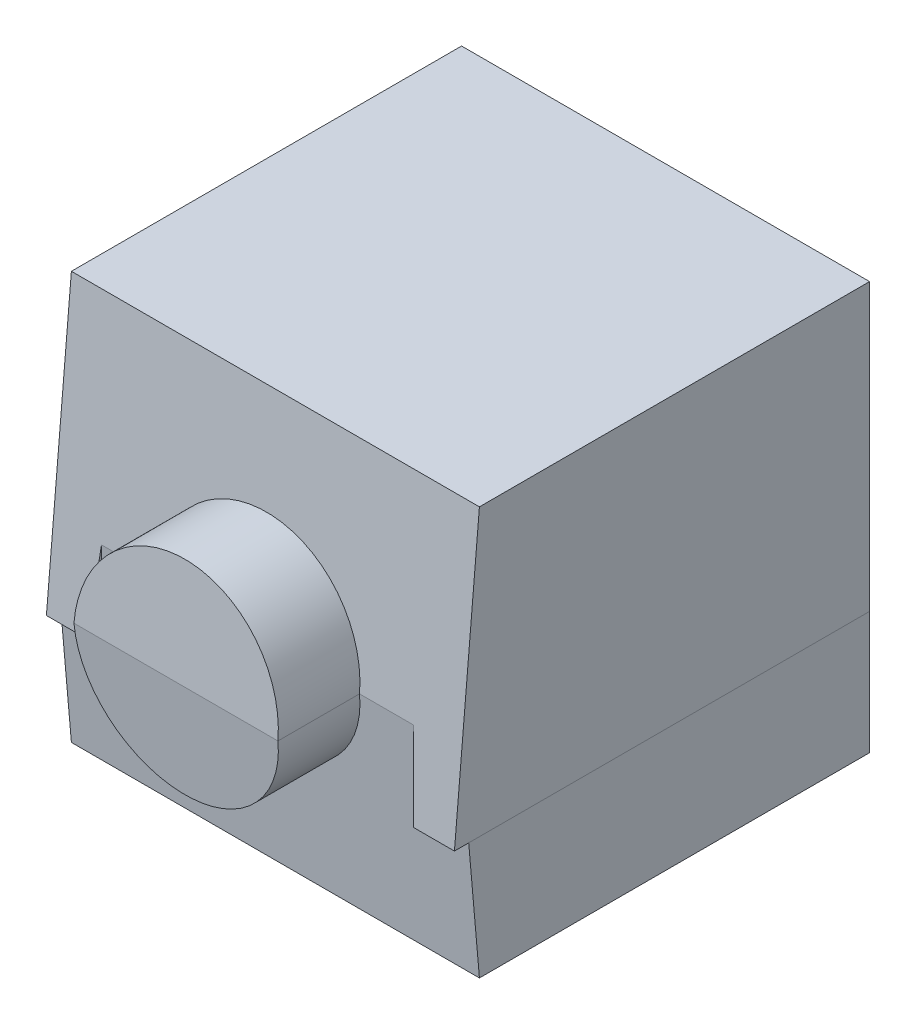
ISO-10303-21;
HEADER;
FILE_DESCRIPTION(('STEP AP214'),'2;1');
FILE_NAME('part.step','',(''),(''),'','','');
FILE_SCHEMA(('AUTOMOTIVE_DESIGN { 1 0 10303 214 1 1 1 1 }'));
ENDSEC;
DATA;
#1=APPLICATION_CONTEXT('core data for automotive mechanical design processes');
#2=APPLICATION_PROTOCOL_DEFINITION('international standard','automotive_design',2000,#1);
#3=PRODUCT_CONTEXT('',#1,'mechanical');
#4=PRODUCT('Part','Part','',(#3));
#5=PRODUCT_RELATED_PRODUCT_CATEGORY('part','',(#4));
#6=PRODUCT_DEFINITION_FORMATION('','',#4);
#7=PRODUCT_DEFINITION_CONTEXT('part definition',#1,'design');
#8=PRODUCT_DEFINITION('design','',#6,#7);
#9=PRODUCT_DEFINITION_SHAPE('','',#8);
#10=(LENGTH_UNIT() NAMED_UNIT(*) SI_UNIT(.MILLI.,.METRE.));
#11=(NAMED_UNIT(*) PLANE_ANGLE_UNIT() SI_UNIT($,.RADIAN.));
#12=(NAMED_UNIT(*) SI_UNIT($,.STERADIAN.) SOLID_ANGLE_UNIT());
#13=UNCERTAINTY_MEASURE_WITH_UNIT(LENGTH_MEASURE(1.E-05),#10,'distance_accuracy_value','');
#14=(GEOMETRIC_REPRESENTATION_CONTEXT(3) GLOBAL_UNCERTAINTY_ASSIGNED_CONTEXT((#13)) GLOBAL_UNIT_ASSIGNED_CONTEXT((#10,
#11,#12)) REPRESENTATION_CONTEXT('',''));
#15=CARTESIAN_POINT('',(0.,0.,0.));
#16=DIRECTION('',(0.,0.,1.));
#17=DIRECTION('',(1.,0.,0.));
#18=AXIS2_PLACEMENT_3D('',#15,#16,#17);
#19=CARTESIAN_POINT('',(5.,-2.,-5.01));
#20=DIRECTION('',(0.,1.,0.));
#21=DIRECTION('',(0.,0.,1.));
#22=AXIS2_PLACEMENT_3D('',#19,#20,#21);
#23=PLANE('',#22);
#24=DIRECTION('',(0.,0.,1.));
#25=VECTOR('',#24,1.);
#26=CARTESIAN_POINT('',(4.,-2.,-5.01));
#27=LINE('',#26,#25);
#28=CARTESIAN_POINT('',(4.,-2.,-5.));
#29=VERTEX_POINT('',#28);
#30=CARTESIAN_POINT('',(4.,-2.,4.82502267294815));
#31=VERTEX_POINT('',#30);
#32=EDGE_CURVE('E12',#29,#31,#27,.T.);
#33=ORIENTED_EDGE('',*,*,#32,.T.);
#34=DIRECTION('',(-1.,0.,0.));
#35=VECTOR('',#34,1.);
#36=CARTESIAN_POINT('',(-5.,-2.,4.82502267294815));
#37=LINE('',#36,#35);
#38=CARTESIAN_POINT('',(5.,-2.,4.82502267294815));
#39=VERTEX_POINT('',#38);
#40=EDGE_CURVE('E172',#31,#39,#37,.F.);
#41=ORIENTED_EDGE('',*,*,#40,.T.);
#42=DIRECTION('',(0.,0.,-1.));
#43=VECTOR('',#42,1.);
#44=CARTESIAN_POINT('',(5.,-2.,-5.));
#45=LINE('',#44,#43);
#46=CARTESIAN_POINT('',(5.,-2.,-5.));
#47=VERTEX_POINT('',#46);
#48=EDGE_CURVE('E175',#39,#47,#45,.T.);
#49=ORIENTED_EDGE('',*,*,#48,.T.);
#50=DIRECTION('',(-1.,0.,0.));
#51=VECTOR('',#50,1.);
#52=CARTESIAN_POINT('',(-5.,-2.,-5.));
#53=LINE('',#52,#51);
#54=EDGE_CURVE('E149',#47,#29,#53,.T.);
#55=ORIENTED_EDGE('',*,*,#54,.T.);
#56=EDGE_LOOP('',(#33,#41,#49,#55));
#57=FACE_BOUND('',#56,.T.);
#58=ADVANCED_FACE('F49',(#57),#23,.T.);
#59=CARTESIAN_POINT('',(-3.82502267294816,0.,-5.01));
#60=DIRECTION('',(0.,1.,0.));
#61=DIRECTION('',(-1.,0.,0.));
#62=AXIS2_PLACEMENT_3D('',#59,#60,#61);
#63=PLANE('',#62);
#64=DIRECTION('',(0.,0.,1.));
#65=VECTOR('',#64,1.);
#66=CARTESIAN_POINT('',(3.82502267294816,0.,-5.01));
#67=LINE('',#66,#65);
#68=CARTESIAN_POINT('',(3.82502267294816,0.,-5.));
#69=VERTEX_POINT('',#68);
#70=CARTESIAN_POINT('',(3.82502267294816,0.,5.));
#71=VERTEX_POINT('',#70);
#72=EDGE_CURVE('E60',#69,#71,#67,.T.);
#73=ORIENTED_EDGE('',*,*,#72,.F.);
#74=DIRECTION('',(-1.,0.,0.));
#75=VECTOR('',#74,1.);
#76=CARTESIAN_POINT('',(-5.,0.,-5.));
#77=LINE('',#76,#75);
#78=CARTESIAN_POINT('',(-3.82502267294816,0.,-5.));
#79=VERTEX_POINT('',#78);
#80=EDGE_CURVE('E208',#69,#79,#77,.T.);
#81=ORIENTED_EDGE('',*,*,#80,.T.);
#82=DIRECTION('',(0.,0.,1.));
#83=VECTOR('',#82,1.);
#84=CARTESIAN_POINT('',(-3.82502267294816,0.,-5.01));
#85=LINE('',#84,#83);
#86=CARTESIAN_POINT('',(-3.82502267294816,0.,5.));
#87=VERTEX_POINT('',#86);
#88=EDGE_CURVE('E193',#79,#87,#85,.T.);
#89=ORIENTED_EDGE('',*,*,#88,.T.);
#90=DIRECTION('',(-1.,0.,0.));
#91=VECTOR('',#90,1.);
#92=CARTESIAN_POINT('',(-5.,0.,5.));
#93=LINE('',#92,#91);
#94=CARTESIAN_POINT('',(-2.5,0.,5.));
#95=VERTEX_POINT('',#94);
#96=EDGE_CURVE('E146',#87,#95,#93,.F.);
#97=ORIENTED_EDGE('',*,*,#96,.T.);
#98=DIRECTION('',(0.,0.,-1.));
#99=VECTOR('',#98,1.);
#100=CARTESIAN_POINT('',(-2.5,0.,7.));
#101=LINE('',#100,#99);
#102=CARTESIAN_POINT('',(-2.5,0.,7.));
#103=VERTEX_POINT('',#102);
#104=EDGE_CURVE('E133',#95,#103,#101,.F.);
#105=ORIENTED_EDGE('',*,*,#104,.T.);
#106=DIRECTION('',(-1.,0.,0.));
#107=VECTOR('',#106,1.);
#108=CARTESIAN_POINT('',(0.,0.,7.));
#109=LINE('',#108,#107);
#110=CARTESIAN_POINT('',(2.5,0.,7.));
#111=VERTEX_POINT('',#110);
#112=EDGE_CURVE('E136',#111,#103,#109,.T.);
#113=ORIENTED_EDGE('',*,*,#112,.F.);
#114=DIRECTION('',(0.,0.,-1.));
#115=VECTOR('',#114,1.);
#116=CARTESIAN_POINT('',(2.5,0.,7.));
#117=LINE('',#116,#115);
#118=CARTESIAN_POINT('',(2.5,0.,5.));
#119=VERTEX_POINT('',#118);
#120=EDGE_CURVE('E130',#111,#119,#117,.T.);
#121=ORIENTED_EDGE('',*,*,#120,.T.);
#122=DIRECTION('',(1.,0.,0.));
#123=VECTOR('',#122,1.);
#124=CARTESIAN_POINT('',(-5.,0.,5.));
#125=LINE('',#124,#123);
#126=EDGE_CURVE('E140',#119,#71,#125,.T.);
#127=ORIENTED_EDGE('',*,*,#126,.T.);
#128=EDGE_LOOP('',(#73,#81,#89,#97,#105,#113,#121,#127));
#129=FACE_BOUND('',#128,.T.);
#130=ADVANCED_FACE('F148',(#129),#63,.T.);
#131=CARTESIAN_POINT('',(4.,-2.,-5.01));
#132=DIRECTION('',(0.996194698091746,0.0871557427476518,0.));
#133=DIRECTION('',(-0.0871557427476518,0.996194698091746,0.));
#134=AXIS2_PLACEMENT_3D('',#131,#132,#133);
#135=PLANE('',#134);
#136=ORIENTED_EDGE('',*,*,#72,.T.);
#137=DIRECTION('',(-0.0868265938642412,0.992432509138968,0.0868265938642477));
#138=VECTOR('',#137,1.);
#139=CARTESIAN_POINT('',(3.75849208544681,0.760448094873979,5.06653058750136));
#140=LINE('',#139,#138);
#141=EDGE_CURVE('E144',#71,#31,#140,.F.);
#142=ORIENTED_EDGE('',*,*,#141,.T.);
#143=ORIENTED_EDGE('',*,*,#32,.F.);
#144=DIRECTION('',(-0.0871557427476518,0.996194698091746,0.));
#145=VECTOR('',#144,1.);
#146=CARTESIAN_POINT('',(3.32386626672073,5.72824393504387,-5.));
#147=LINE('',#146,#145);
#148=EDGE_CURVE('E152',#29,#69,#147,.T.);
#149=ORIENTED_EDGE('',*,*,#148,.T.);
#150=EDGE_LOOP('',(#136,#142,#143,#149));
#151=FACE_BOUND('',#150,.T.);
#152=ADVANCED_FACE('F214',(#151),#135,.T.);
#153=CARTESIAN_POINT('',(-4.,-2.,-5.01));
#154=DIRECTION('',(-0.996194698091746,0.0871557427476518,0.));
#155=DIRECTION('',(-0.0871557427476518,-0.996194698091746,0.));
#156=AXIS2_PLACEMENT_3D('',#153,#154,#155);
#157=PLANE('',#156);
#158=DIRECTION('',(0.,0.,1.));
#159=VECTOR('',#158,1.);
#160=CARTESIAN_POINT('',(-4.,-2.,-5.01));
#161=LINE('',#160,#159);
#162=CARTESIAN_POINT('',(-4.,-2.,-5.));
#163=VERTEX_POINT('',#162);
#164=CARTESIAN_POINT('',(-4.,-2.,4.82502267294815));
#165=VERTEX_POINT('',#164);
#166=EDGE_CURVE('E195',#163,#165,#161,.T.);
#167=ORIENTED_EDGE('',*,*,#166,.T.);
#168=DIRECTION('',(-0.0868265938642412,-0.992432509138968,-0.0868265938642477));
#169=VECTOR('',#168,1.);
#170=CARTESIAN_POINT('',(-3.83388065946747,-0.101247249212811,4.9911420134807));
#171=LINE('',#170,#169);
#172=EDGE_CURVE('E167',#165,#87,#171,.F.);
#173=ORIENTED_EDGE('',*,*,#172,.T.);
#174=ORIENTED_EDGE('',*,*,#88,.F.);
#175=DIRECTION('',(-0.0871557427476518,-0.996194698091746,0.));
#176=VECTOR('',#175,1.);
#177=CARTESIAN_POINT('',(-3.39982750165968,4.86000304670928,-5.));
#178=LINE('',#177,#176);
#179=EDGE_CURVE('E205',#79,#163,#178,.T.);
#180=ORIENTED_EDGE('',*,*,#179,.T.);
#181=EDGE_LOOP('',(#167,#173,#174,#180));
#182=FACE_BOUND('',#181,.T.);
#183=ADVANCED_FACE('F222',(#182),#157,.T.);
#184=CARTESIAN_POINT('',(-5.,-2.,-5.01));
#185=DIRECTION('',(0.,1.,0.));
#186=DIRECTION('',(0.,0.,1.));
#187=AXIS2_PLACEMENT_3D('',#184,#185,#186);
#188=PLANE('',#187);
#189=DIRECTION('',(0.,0.,1.));
#190=VECTOR('',#189,1.);
#191=CARTESIAN_POINT('',(-5.,-2.,-5.));
#192=LINE('',#191,#190);
#193=CARTESIAN_POINT('',(-5.,-2.,-5.));
#194=VERTEX_POINT('',#193);
#195=CARTESIAN_POINT('',(-5.,-2.,4.82502267294815));
#196=VERTEX_POINT('',#195);
#197=EDGE_CURVE('E166',#194,#196,#192,.T.);
#198=ORIENTED_EDGE('',*,*,#197,.T.);
#199=DIRECTION('',(-1.,0.,0.));
#200=VECTOR('',#199,1.);
#201=CARTESIAN_POINT('',(-5.,-2.,4.82502267294815));
#202=LINE('',#201,#200);
#203=EDGE_CURVE('E163',#196,#165,#202,.F.);
#204=ORIENTED_EDGE('',*,*,#203,.T.);
#205=ORIENTED_EDGE('',*,*,#166,.F.);
#206=DIRECTION('',(-1.,0.,0.));
#207=VECTOR('',#206,1.);
#208=CARTESIAN_POINT('',(-5.,-2.,-5.));
#209=LINE('',#208,#207);
#210=EDGE_CURVE('E202',#163,#194,#209,.T.);
#211=ORIENTED_EDGE('',*,*,#210,.T.);
#212=EDGE_LOOP('',(#198,#204,#205,#211));
#213=FACE_BOUND('',#212,.T.);
#214=ADVANCED_FACE('F224',(#213),#188,.T.);
#215=CARTESIAN_POINT('',(-5.,0.,5.));
#216=DIRECTION('',(0.,-0.0871557427476582,0.996194698091746));
#217=DIRECTION('',(0.,-0.996194698091746,-0.0871557427476582));
#218=AXIS2_PLACEMENT_3D('',#215,#216,#217);
#219=PLANE('',#218);
#220=ORIENTED_EDGE('',*,*,#203,.F.);
#221=DIRECTION('',(0.,0.996194698091746,0.0871557427476582));
#222=VECTOR('',#221,1.);
#223=CARTESIAN_POINT('',(-5.,0.,5.));
#224=LINE('',#223,#222);
#225=CARTESIAN_POINT('',(-5.,-5.,4.56255668237038));
#226=VERTEX_POINT('',#225);
#227=EDGE_CURVE('E68',#196,#226,#224,.F.);
#228=ORIENTED_EDGE('',*,*,#227,.T.);
#229=DIRECTION('',(-1.,0.,0.));
#230=VECTOR('',#229,1.);
#231=CARTESIAN_POINT('',(-5.,-5.,4.56255668237038));
#232=LINE('',#231,#230);
#233=CARTESIAN_POINT('',(5.,-5.,4.56255668237038));
#234=VERTEX_POINT('',#233);
#235=EDGE_CURVE('E177',#226,#234,#232,.F.);
#236=ORIENTED_EDGE('',*,*,#235,.T.);
#237=DIRECTION('',(0.,0.996194698091746,0.0871557427476582));
#238=VECTOR('',#237,1.);
#239=CARTESIAN_POINT('',(5.,4.09377849419587,5.35815920922837));
#240=LINE('',#239,#238);
#241=EDGE_CURVE('E160',#39,#234,#240,.F.);
#242=ORIENTED_EDGE('',*,*,#241,.F.);
#243=ORIENTED_EDGE('',*,*,#40,.F.);
#244=ORIENTED_EDGE('',*,*,#141,.F.);
#245=ORIENTED_EDGE('',*,*,#126,.F.);
#246=CARTESIAN_POINT('',(0.,0.,5.));
#247=DIRECTION('',(0.,-0.0871557427476582,0.996194698091746));
#248=DIRECTION('',(0.,-0.996194698091746,-0.0871557427476582));
#249=AXIS2_PLACEMENT_3D('',#246,#247,#248);
#250=ELLIPSE('',#249,2.50954959385837,2.5);
#251=EDGE_CURVE('E125',#95,#119,#250,.T.);
#252=ORIENTED_EDGE('',*,*,#251,.F.);
#253=ORIENTED_EDGE('',*,*,#96,.F.);
#254=ORIENTED_EDGE('',*,*,#172,.F.);
#255=EDGE_LOOP('',(#220,#228,#236,#242,#243,#244,#245,#252,#253,#254));
#256=FACE_BOUND('',#255,.T.);
#257=ADVANCED_FACE('F141',(#256),#219,.T.);
#258=CARTESIAN_POINT('',(0.,0.,7.));
#259=DIRECTION('',(0.,0.,-1.));
#260=DIRECTION('',(-1.,0.,0.));
#261=AXIS2_PLACEMENT_3D('',#258,#259,#260);
#262=CYLINDRICAL_SURFACE('',#261,2.5);
#263=ORIENTED_EDGE('',*,*,#120,.F.);
#264=CARTESIAN_POINT('',(0.,0.,7.));
#265=DIRECTION('',(0.,-0.0871557427476582,0.996194698091746));
#266=DIRECTION('',(0.,-0.996194698091746,-0.0871557427476582));
#267=AXIS2_PLACEMENT_3D('',#264,#265,#266);
#268=ELLIPSE('',#267,2.50954959385837,2.5);
#269=EDGE_CURVE('E53',#103,#111,#268,.T.);
#270=ORIENTED_EDGE('',*,*,#269,.F.);
#271=ORIENTED_EDGE('',*,*,#104,.F.);
#272=ORIENTED_EDGE('',*,*,#251,.T.);
#273=EDGE_LOOP('',(#263,#270,#271,#272));
#274=FACE_BOUND('',#273,.T.);
#275=ADVANCED_FACE('F127',(#274),#262,.T.);
#276=CARTESIAN_POINT('',(0.,0.,7.));
#277=DIRECTION('',(0.,-0.0871557427476582,0.996194698091746));
#278=DIRECTION('',(0.,-0.996194698091746,-0.0871557427476582));
#279=AXIS2_PLACEMENT_3D('',#276,#277,#278);
#280=PLANE('',#279);
#281=ORIENTED_EDGE('',*,*,#269,.T.);
#282=ORIENTED_EDGE('',*,*,#112,.T.);
#283=EDGE_LOOP('',(#281,#282));
#284=FACE_BOUND('',#283,.T.);
#285=ADVANCED_FACE('F51',(#284),#280,.T.);
#286=CARTESIAN_POINT('',(-5.,5.,-5.));
#287=DIRECTION('',(1.,0.,0.));
#288=DIRECTION('',(0.,0.,-1.));
#289=AXIS2_PLACEMENT_3D('',#286,#287,#288);
#290=PLANE('',#289);
#291=ORIENTED_EDGE('',*,*,#197,.F.);
#292=DIRECTION('',(0.,-1.,0.));
#293=VECTOR('',#292,1.);
#294=CARTESIAN_POINT('',(-5.,5.,-5.));
#295=LINE('',#294,#293);
#296=CARTESIAN_POINT('',(-5.,-5.,-5.));
#297=VERTEX_POINT('',#296);
#298=EDGE_CURVE('E159',#194,#297,#295,.T.);
#299=ORIENTED_EDGE('',*,*,#298,.T.);
#300=DIRECTION('',(0.,0.,1.));
#301=VECTOR('',#300,1.);
#302=CARTESIAN_POINT('',(-5.,-5.,-5.));
#303=LINE('',#302,#301);
#304=EDGE_CURVE('E178',#297,#226,#303,.T.);
#305=ORIENTED_EDGE('',*,*,#304,.T.);
#306=ORIENTED_EDGE('',*,*,#227,.F.);
#307=EDGE_LOOP('',(#291,#299,#305,#306));
#308=FACE_BOUND('',#307,.T.);
#309=ADVANCED_FACE('F227',(#308),#290,.F.);
#310=CARTESIAN_POINT('',(0.,-5.,0.));
#311=DIRECTION('',(0.,1.,0.));
#312=DIRECTION('',(0.,0.,1.));
#313=AXIS2_PLACEMENT_3D('',#310,#311,#312);
#314=PLANE('',#313);
#315=ORIENTED_EDGE('',*,*,#304,.F.);
#316=DIRECTION('',(-1.,0.,0.));
#317=VECTOR('',#316,1.);
#318=CARTESIAN_POINT('',(-5.,-5.,-5.));
#319=LINE('',#318,#317);
#320=CARTESIAN_POINT('',(5.,-5.,-5.));
#321=VERTEX_POINT('',#320);
#322=EDGE_CURVE('E162',#321,#297,#319,.T.);
#323=ORIENTED_EDGE('',*,*,#322,.F.);
#324=DIRECTION('',(0.,0.,-1.));
#325=VECTOR('',#324,1.);
#326=CARTESIAN_POINT('',(5.,-5.,-5.));
#327=LINE('',#326,#325);
#328=EDGE_CURVE('E179',#234,#321,#327,.T.);
#329=ORIENTED_EDGE('',*,*,#328,.F.);
#330=ORIENTED_EDGE('',*,*,#235,.F.);
#331=EDGE_LOOP('',(#315,#323,#329,#330));
#332=FACE_BOUND('',#331,.T.);
#333=ADVANCED_FACE('F230',(#332),#314,.F.);
#334=CARTESIAN_POINT('',(5.,5.,-5.));
#335=DIRECTION('',(-1.,0.,0.));
#336=DIRECTION('',(0.,0.,1.));
#337=AXIS2_PLACEMENT_3D('',#334,#335,#336);
#338=PLANE('',#337);
#339=ORIENTED_EDGE('',*,*,#48,.F.);
#340=ORIENTED_EDGE('',*,*,#241,.T.);
#341=ORIENTED_EDGE('',*,*,#328,.T.);
#342=DIRECTION('',(0.,-1.,0.));
#343=VECTOR('',#342,1.);
#344=CARTESIAN_POINT('',(5.,5.,-5.));
#345=LINE('',#344,#343);
#346=EDGE_CURVE('E157',#47,#321,#345,.T.);
#347=ORIENTED_EDGE('',*,*,#346,.F.);
#348=EDGE_LOOP('',(#339,#340,#341,#347));
#349=FACE_BOUND('',#348,.T.);
#350=ADVANCED_FACE('F232',(#349),#338,.F.);
#351=CARTESIAN_POINT('',(-5.,5.,-5.));
#352=DIRECTION('',(0.,0.,1.));
#353=DIRECTION('',(1.,0.,0.));
#354=AXIS2_PLACEMENT_3D('',#351,#352,#353);
#355=PLANE('',#354);
#356=ORIENTED_EDGE('',*,*,#210,.F.);
#357=ORIENTED_EDGE('',*,*,#179,.F.);
#358=ORIENTED_EDGE('',*,*,#80,.F.);
#359=ORIENTED_EDGE('',*,*,#148,.F.);
#360=ORIENTED_EDGE('',*,*,#54,.F.);
#361=ORIENTED_EDGE('',*,*,#346,.T.);
#362=ORIENTED_EDGE('',*,*,#322,.T.);
#363=ORIENTED_EDGE('',*,*,#298,.F.);
#364=EDGE_LOOP('',(#356,#357,#358,#359,#360,#361,#362,#363));
#365=FACE_BOUND('',#364,.T.);
#366=ADVANCED_FACE('F219',(#365),#355,.F.);
#367=CLOSED_SHELL('',(#58,#130,#152,#183,#214,#257,#275,#285,#309,#333,#350,#366));
#368=MANIFOLD_SOLID_BREP('B2',#367);
#369=CARTESIAN_POINT('',(-3.82502267294816,0.,-5.01));
#370=DIRECTION('',(0.,1.,0.));
#371=DIRECTION('',(-1.,0.,0.));
#372=AXIS2_PLACEMENT_3D('',#369,#370,#371);
#373=PLANE('',#372);
#374=DIRECTION('',(0.,0.,1.));
#375=VECTOR('',#374,1.);
#376=CARTESIAN_POINT('',(3.82502267294816,0.,-5.01));
#377=LINE('',#376,#375);
#378=CARTESIAN_POINT('',(3.82502267294816,0.,-5.));
#379=VERTEX_POINT('',#378);
#380=CARTESIAN_POINT('',(3.82502267294816,0.,5.));
#381=VERTEX_POINT('',#380);
#382=EDGE_CURVE('E348',#379,#381,#377,.T.);
#383=ORIENTED_EDGE('',*,*,#382,.T.);
#384=DIRECTION('',(-1.,0.,0.));
#385=VECTOR('',#384,1.);
#386=CARTESIAN_POINT('',(-5.,0.,5.));
#387=LINE('',#386,#385);
#388=CARTESIAN_POINT('',(2.5,0.,5.));
#389=VERTEX_POINT('',#388);
#390=EDGE_CURVE('E441',#389,#381,#387,.F.);
#391=ORIENTED_EDGE('',*,*,#390,.F.);
#392=DIRECTION('',(0.,0.,-1.));
#393=VECTOR('',#392,1.);
#394=CARTESIAN_POINT('',(2.5,0.,7.));
#395=LINE('',#394,#393);
#396=CARTESIAN_POINT('',(2.5,0.,7.));
#397=VERTEX_POINT('',#396);
#398=EDGE_CURVE('E450',#397,#389,#395,.T.);
#399=ORIENTED_EDGE('',*,*,#398,.F.);
#400=DIRECTION('',(-1.,0.,0.));
#401=VECTOR('',#400,1.);
#402=CARTESIAN_POINT('',(0.,0.,7.));
#403=LINE('',#402,#401);
#404=CARTESIAN_POINT('',(-2.5,0.,7.));
#405=VERTEX_POINT('',#404);
#406=EDGE_CURVE('E356',#397,#405,#403,.T.);
#407=ORIENTED_EDGE('',*,*,#406,.T.);
#408=DIRECTION('',(0.,0.,-1.));
#409=VECTOR('',#408,1.);
#410=CARTESIAN_POINT('',(-2.5,0.,7.));
#411=LINE('',#410,#409);
#412=CARTESIAN_POINT('',(-2.5,0.,5.));
#413=VERTEX_POINT('',#412);
#414=EDGE_CURVE('E423',#413,#405,#411,.F.);
#415=ORIENTED_EDGE('',*,*,#414,.F.);
#416=DIRECTION('',(1.,0.,0.));
#417=VECTOR('',#416,1.);
#418=CARTESIAN_POINT('',(-5.,0.,5.));
#419=LINE('',#418,#417);
#420=CARTESIAN_POINT('',(-3.82502267294816,0.,5.));
#421=VERTEX_POINT('',#420);
#422=EDGE_CURVE('E442',#421,#413,#419,.T.);
#423=ORIENTED_EDGE('',*,*,#422,.F.);
#424=DIRECTION('',(0.,0.,1.));
#425=VECTOR('',#424,1.);
#426=CARTESIAN_POINT('',(-3.82502267294816,0.,-5.01));
#427=LINE('',#426,#425);
#428=CARTESIAN_POINT('',(-3.82502267294816,0.,-5.));
#429=VERTEX_POINT('',#428);
#430=EDGE_CURVE('E478',#429,#421,#427,.T.);
#431=ORIENTED_EDGE('',*,*,#430,.F.);
#432=DIRECTION('',(-1.,0.,0.));
#433=VECTOR('',#432,1.);
#434=CARTESIAN_POINT('',(-5.,0.,-5.));
#435=LINE('',#434,#433);
#436=EDGE_CURVE('E452',#379,#429,#435,.T.);
#437=ORIENTED_EDGE('',*,*,#436,.F.);
#438=EDGE_LOOP('',(#383,#391,#399,#407,#415,#423,#431,#437));
#439=FACE_BOUND('',#438,.T.);
#440=ADVANCED_FACE('F337',(#439),#373,.F.);
#441=CARTESIAN_POINT('',(5.,-2.,-5.01));
#442=DIRECTION('',(0.,1.,0.));
#443=DIRECTION('',(0.,0.,1.));
#444=AXIS2_PLACEMENT_3D('',#441,#442,#443);
#445=PLANE('',#444);
#446=DIRECTION('',(0.,0.,1.));
#447=VECTOR('',#446,1.);
#448=CARTESIAN_POINT('',(4.,-2.,-5.01));
#449=LINE('',#448,#447);
#450=CARTESIAN_POINT('',(4.,-2.,-5.));
#451=VERTEX_POINT('',#450);
#452=CARTESIAN_POINT('',(4.,-2.,5.17497732705185));
#453=VERTEX_POINT('',#452);
#454=EDGE_CURVE('E47',#451,#453,#449,.T.);
#455=ORIENTED_EDGE('',*,*,#454,.F.);
#456=DIRECTION('',(-1.,0.,0.));
#457=VECTOR('',#456,1.);
#458=CARTESIAN_POINT('',(-5.,-2.,-5.));
#459=LINE('',#458,#457);
#460=CARTESIAN_POINT('',(5.,-2.,-5.));
#461=VERTEX_POINT('',#460);
#462=EDGE_CURVE('E451',#461,#451,#459,.T.);
#463=ORIENTED_EDGE('',*,*,#462,.F.);
#464=DIRECTION('',(0.,0.,-1.));
#465=VECTOR('',#464,1.);
#466=CARTESIAN_POINT('',(5.,-2.,-5.));
#467=LINE('',#466,#465);
#468=CARTESIAN_POINT('',(5.,-2.,5.17497732705185));
#469=VERTEX_POINT('',#468);
#470=EDGE_CURVE('E438',#469,#461,#467,.T.);
#471=ORIENTED_EDGE('',*,*,#470,.F.);
#472=DIRECTION('',(-1.,0.,0.));
#473=VECTOR('',#472,1.);
#474=CARTESIAN_POINT('',(-5.,-2.,5.17497732705185));
#475=LINE('',#474,#473);
#476=EDGE_CURVE('E435',#453,#469,#475,.F.);
#477=ORIENTED_EDGE('',*,*,#476,.F.);
#478=EDGE_LOOP('',(#455,#463,#471,#477));
#479=FACE_BOUND('',#478,.T.);
#480=ADVANCED_FACE('F511',(#479),#445,.F.);
#481=CARTESIAN_POINT('',(4.,-2.,-5.01));
#482=DIRECTION('',(0.996194698091746,0.0871557427476518,0.));
#483=DIRECTION('',(-0.0871557427476518,0.996194698091746,0.));
#484=AXIS2_PLACEMENT_3D('',#481,#482,#483);
#485=PLANE('',#484);
#486=ORIENTED_EDGE('',*,*,#382,.F.);
#487=DIRECTION('',(-0.0871557427476518,0.996194698091746,0.));
#488=VECTOR('',#487,1.);
#489=CARTESIAN_POINT('',(3.32386626672073,5.72824393504387,-5.));
#490=LINE('',#489,#488);
#491=EDGE_CURVE('E455',#451,#379,#490,.T.);
#492=ORIENTED_EDGE('',*,*,#491,.F.);
#493=ORIENTED_EDGE('',*,*,#454,.T.);
#494=DIRECTION('',(-0.0868265938642412,0.992432509138968,-0.0868265938642477));
#495=VECTOR('',#494,1.);
#496=CARTESIAN_POINT('',(3.75849208544681,0.760448094873979,4.93346941249864));
#497=LINE('',#496,#495);
#498=EDGE_CURVE('E437',#381,#453,#497,.F.);
#499=ORIENTED_EDGE('',*,*,#498,.F.);
#500=EDGE_LOOP('',(#486,#492,#493,#499));
#501=FACE_BOUND('',#500,.T.);
#502=ADVANCED_FACE('F514',(#501),#485,.F.);
#503=CARTESIAN_POINT('',(-4.,-2.,-5.01));
#504=DIRECTION('',(-0.996194698091746,0.0871557427476518,0.));
#505=DIRECTION('',(-0.0871557427476518,-0.996194698091746,0.));
#506=AXIS2_PLACEMENT_3D('',#503,#504,#505);
#507=PLANE('',#506);
#508=DIRECTION('',(0.,0.,1.));
#509=VECTOR('',#508,1.);
#510=CARTESIAN_POINT('',(-4.,-2.,-5.01));
#511=LINE('',#510,#509);
#512=CARTESIAN_POINT('',(-4.,-2.,-5.));
#513=VERTEX_POINT('',#512);
#514=CARTESIAN_POINT('',(-4.,-2.,5.17497732705185));
#515=VERTEX_POINT('',#514);
#516=EDGE_CURVE('E405',#513,#515,#511,.T.);
#517=ORIENTED_EDGE('',*,*,#516,.F.);
#518=DIRECTION('',(-0.0871557427476518,-0.996194698091746,0.));
#519=VECTOR('',#518,1.);
#520=CARTESIAN_POINT('',(-3.39982750165968,4.86000304670928,-5.));
#521=LINE('',#520,#519);
#522=EDGE_CURVE('E454',#429,#513,#521,.T.);
#523=ORIENTED_EDGE('',*,*,#522,.F.);
#524=ORIENTED_EDGE('',*,*,#430,.T.);
#525=DIRECTION('',(-0.0868265938642412,-0.992432509138968,0.0868265938642477));
#526=VECTOR('',#525,1.);
#527=CARTESIAN_POINT('',(-3.83388065946747,-0.101247249212811,5.00885798651931));
#528=LINE('',#527,#526);
#529=EDGE_CURVE('E392',#515,#421,#528,.F.);
#530=ORIENTED_EDGE('',*,*,#529,.F.);
#531=EDGE_LOOP('',(#517,#523,#524,#530));
#532=FACE_BOUND('',#531,.T.);
#533=ADVANCED_FACE('F516',(#532),#507,.F.);
#534=CARTESIAN_POINT('',(-5.,-2.,-5.01));
#535=DIRECTION('',(0.,1.,0.));
#536=DIRECTION('',(0.,0.,1.));
#537=AXIS2_PLACEMENT_3D('',#534,#535,#536);
#538=PLANE('',#537);
#539=DIRECTION('',(0.,0.,1.));
#540=VECTOR('',#539,1.);
#541=CARTESIAN_POINT('',(-5.,-2.,-5.));
#542=LINE('',#541,#540);
#543=CARTESIAN_POINT('',(-5.,-2.,-5.));
#544=VERTEX_POINT('',#543);
#545=CARTESIAN_POINT('',(-5.,-2.,5.17497732705185));
#546=VERTEX_POINT('',#545);
#547=EDGE_CURVE('E403',#544,#546,#542,.T.);
#548=ORIENTED_EDGE('',*,*,#547,.F.);
#549=DIRECTION('',(-1.,0.,0.));
#550=VECTOR('',#549,1.);
#551=CARTESIAN_POINT('',(-5.,-2.,-5.));
#552=LINE('',#551,#550);
#553=EDGE_CURVE('E462',#513,#544,#552,.T.);
#554=ORIENTED_EDGE('',*,*,#553,.F.);
#555=ORIENTED_EDGE('',*,*,#516,.T.);
#556=DIRECTION('',(-1.,0.,0.));
#557=VECTOR('',#556,1.);
#558=CARTESIAN_POINT('',(-5.,-2.,5.17497732705185));
#559=LINE('',#558,#557);
#560=EDGE_CURVE('E341',#546,#515,#559,.F.);
#561=ORIENTED_EDGE('',*,*,#560,.F.);
#562=EDGE_LOOP('',(#548,#554,#555,#561));
#563=FACE_BOUND('',#562,.T.);
#564=ADVANCED_FACE('F401',(#563),#538,.F.);
#565=CARTESIAN_POINT('',(-5.,5.,-5.));
#566=DIRECTION('',(1.,0.,0.));
#567=DIRECTION('',(0.,0.,-1.));
#568=AXIS2_PLACEMENT_3D('',#565,#566,#567);
#569=PLANE('',#568);
#570=DIRECTION('',(0.,-1.,0.));
#571=VECTOR('',#570,1.);
#572=CARTESIAN_POINT('',(-5.,5.,-5.));
#573=LINE('',#572,#571);
#574=CARTESIAN_POINT('',(-5.,5.,-5.));
#575=VERTEX_POINT('',#574);
#576=EDGE_CURVE('E414',#575,#544,#573,.T.);
#577=ORIENTED_EDGE('',*,*,#576,.T.);
#578=ORIENTED_EDGE('',*,*,#547,.T.);
#579=DIRECTION('',(0.,0.996194698091746,-0.0871557427476582));
#580=VECTOR('',#579,1.);
#581=CARTESIAN_POINT('',(-5.,0.,5.));
#582=LINE('',#581,#580);
#583=CARTESIAN_POINT('',(-5.,5.,4.56255668237038));
#584=VERTEX_POINT('',#583);
#585=EDGE_CURVE('E412',#584,#546,#582,.F.);
#586=ORIENTED_EDGE('',*,*,#585,.F.);
#587=DIRECTION('',(0.,0.,1.));
#588=VECTOR('',#587,1.);
#589=CARTESIAN_POINT('',(-5.,5.,-5.));
#590=LINE('',#589,#588);
#591=EDGE_CURVE('E433',#575,#584,#590,.T.);
#592=ORIENTED_EDGE('',*,*,#591,.F.);
#593=EDGE_LOOP('',(#577,#578,#586,#592));
#594=FACE_BOUND('',#593,.T.);
#595=ADVANCED_FACE('F410',(#594),#569,.F.);
#596=CARTESIAN_POINT('',(-5.,0.,5.));
#597=DIRECTION('',(0.,0.0871557427476582,0.996194698091746));
#598=DIRECTION('',(0.,-0.996194698091746,0.0871557427476582));
#599=AXIS2_PLACEMENT_3D('',#596,#597,#598);
#600=PLANE('',#599);
#601=ORIENTED_EDGE('',*,*,#585,.T.);
#602=ORIENTED_EDGE('',*,*,#560,.T.);
#603=ORIENTED_EDGE('',*,*,#529,.T.);
#604=ORIENTED_EDGE('',*,*,#422,.T.);
#605=CARTESIAN_POINT('',(0.,0.,5.));
#606=DIRECTION('',(0.,0.0871557427476582,0.996194698091746));
#607=DIRECTION('',(0.,0.996194698091746,-0.0871557427476582));
#608=AXIS2_PLACEMENT_3D('',#605,#606,#607);
#609=ELLIPSE('',#608,2.50954959385837,2.5);
#610=EDGE_CURVE('E419',#389,#413,#609,.T.);
#611=ORIENTED_EDGE('',*,*,#610,.F.);
#612=ORIENTED_EDGE('',*,*,#390,.T.);
#613=ORIENTED_EDGE('',*,*,#498,.T.);
#614=ORIENTED_EDGE('',*,*,#476,.T.);
#615=DIRECTION('',(0.,0.996194698091746,-0.0871557427476582));
#616=VECTOR('',#615,1.);
#617=CARTESIAN_POINT('',(5.,5.83026027086517,4.48991832089372));
#618=LINE('',#617,#616);
#619=CARTESIAN_POINT('',(5.,5.,4.56255668237038));
#620=VERTEX_POINT('',#619);
#621=EDGE_CURVE('E420',#620,#469,#618,.F.);
#622=ORIENTED_EDGE('',*,*,#621,.F.);
#623=DIRECTION('',(-1.,0.,0.));
#624=VECTOR('',#623,1.);
#625=CARTESIAN_POINT('',(-5.,5.,4.56255668237038));
#626=LINE('',#625,#624);
#627=EDGE_CURVE('E417',#584,#620,#626,.F.);
#628=ORIENTED_EDGE('',*,*,#627,.F.);
#629=EDGE_LOOP('',(#601,#602,#603,#604,#611,#612,#613,#614,#622,#628));
#630=FACE_BOUND('',#629,.T.);
#631=ADVANCED_FACE('F339',(#630),#600,.T.);
#632=CARTESIAN_POINT('',(5.,5.,-5.));
#633=DIRECTION('',(-1.,0.,0.));
#634=DIRECTION('',(0.,0.,1.));
#635=AXIS2_PLACEMENT_3D('',#632,#633,#634);
#636=PLANE('',#635);
#637=ORIENTED_EDGE('',*,*,#621,.T.);
#638=ORIENTED_EDGE('',*,*,#470,.T.);
#639=DIRECTION('',(0.,-1.,0.));
#640=VECTOR('',#639,1.);
#641=CARTESIAN_POINT('',(5.,5.,-5.));
#642=LINE('',#641,#640);
#643=CARTESIAN_POINT('',(5.,5.,-5.));
#644=VERTEX_POINT('',#643);
#645=EDGE_CURVE('E426',#644,#461,#642,.T.);
#646=ORIENTED_EDGE('',*,*,#645,.F.);
#647=DIRECTION('',(0.,0.,-1.));
#648=VECTOR('',#647,1.);
#649=CARTESIAN_POINT('',(5.,5.,-5.));
#650=LINE('',#649,#648);
#651=EDGE_CURVE('E432',#620,#644,#650,.T.);
#652=ORIENTED_EDGE('',*,*,#651,.F.);
#653=EDGE_LOOP('',(#637,#638,#646,#652));
#654=FACE_BOUND('',#653,.T.);
#655=ADVANCED_FACE('F520',(#654),#636,.F.);
#656=CARTESIAN_POINT('',(-5.,5.,-5.));
#657=DIRECTION('',(0.,0.,1.));
#658=DIRECTION('',(1.,0.,0.));
#659=AXIS2_PLACEMENT_3D('',#656,#657,#658);
#660=PLANE('',#659);
#661=ORIENTED_EDGE('',*,*,#522,.T.);
#662=ORIENTED_EDGE('',*,*,#553,.T.);
#663=ORIENTED_EDGE('',*,*,#576,.F.);
#664=DIRECTION('',(-1.,0.,0.));
#665=VECTOR('',#664,1.);
#666=CARTESIAN_POINT('',(-5.,5.,-5.));
#667=LINE('',#666,#665);
#668=EDGE_CURVE('E484',#644,#575,#667,.T.);
#669=ORIENTED_EDGE('',*,*,#668,.F.);
#670=ORIENTED_EDGE('',*,*,#645,.T.);
#671=ORIENTED_EDGE('',*,*,#462,.T.);
#672=ORIENTED_EDGE('',*,*,#491,.T.);
#673=ORIENTED_EDGE('',*,*,#436,.T.);
#674=EDGE_LOOP('',(#661,#662,#663,#669,#670,#671,#672,#673));
#675=FACE_BOUND('',#674,.T.);
#676=ADVANCED_FACE('F506',(#675),#660,.F.);
#677=CARTESIAN_POINT('',(0.,5.,0.));
#678=DIRECTION('',(0.,1.,0.));
#679=DIRECTION('',(0.,0.,1.));
#680=AXIS2_PLACEMENT_3D('',#677,#678,#679);
#681=PLANE('',#680);
#682=ORIENTED_EDGE('',*,*,#591,.T.);
#683=ORIENTED_EDGE('',*,*,#627,.T.);
#684=ORIENTED_EDGE('',*,*,#651,.T.);
#685=ORIENTED_EDGE('',*,*,#668,.T.);
#686=EDGE_LOOP('',(#682,#683,#684,#685));
#687=FACE_BOUND('',#686,.T.);
#688=ADVANCED_FACE('F517',(#687),#681,.T.);
#689=CARTESIAN_POINT('',(0.,0.,7.));
#690=DIRECTION('',(0.,0.,-1.));
#691=DIRECTION('',(-1.,0.,0.));
#692=AXIS2_PLACEMENT_3D('',#689,#690,#691);
#693=CYLINDRICAL_SURFACE('',#692,2.5);
#694=CARTESIAN_POINT('',(0.,0.,7.));
#695=DIRECTION('',(0.,0.0871557427476582,0.996194698091746));
#696=DIRECTION('',(0.,0.996194698091746,-0.0871557427476582));
#697=AXIS2_PLACEMENT_3D('',#694,#695,#696);
#698=ELLIPSE('',#697,2.50954959385837,2.5);
#699=EDGE_CURVE('E430',#397,#405,#698,.T.);
#700=ORIENTED_EDGE('',*,*,#699,.F.);
#701=ORIENTED_EDGE('',*,*,#398,.T.);
#702=ORIENTED_EDGE('',*,*,#610,.T.);
#703=ORIENTED_EDGE('',*,*,#414,.T.);
#704=EDGE_LOOP('',(#700,#701,#702,#703));
#705=FACE_BOUND('',#704,.T.);
#706=ADVANCED_FACE('F493',(#705),#693,.T.);
#707=CARTESIAN_POINT('',(0.,0.,7.));
#708=DIRECTION('',(0.,0.0871557427476582,0.996194698091746));
#709=DIRECTION('',(0.,-0.996194698091746,0.0871557427476582));
#710=AXIS2_PLACEMENT_3D('',#707,#708,#709);
#711=PLANE('',#710);
#712=ORIENTED_EDGE('',*,*,#406,.F.);
#713=ORIENTED_EDGE('',*,*,#699,.T.);
#714=EDGE_LOOP('',(#712,#713));
#715=FACE_BOUND('',#714,.T.);
#716=ADVANCED_FACE('F491',(#715),#711,.T.);
#717=CLOSED_SHELL('',(#440,#480,#502,#533,#564,#595,#631,#655,#676,#688,#706,#716));
#718=MANIFOLD_SOLID_BREP('B6',#717);
#719=ADVANCED_BREP_SHAPE_REPRESENTATION('',(#18,#368,#718),#14);
#720=SHAPE_DEFINITION_REPRESENTATION(#9,#719);
ENDSEC;
END-ISO-10303-21;
